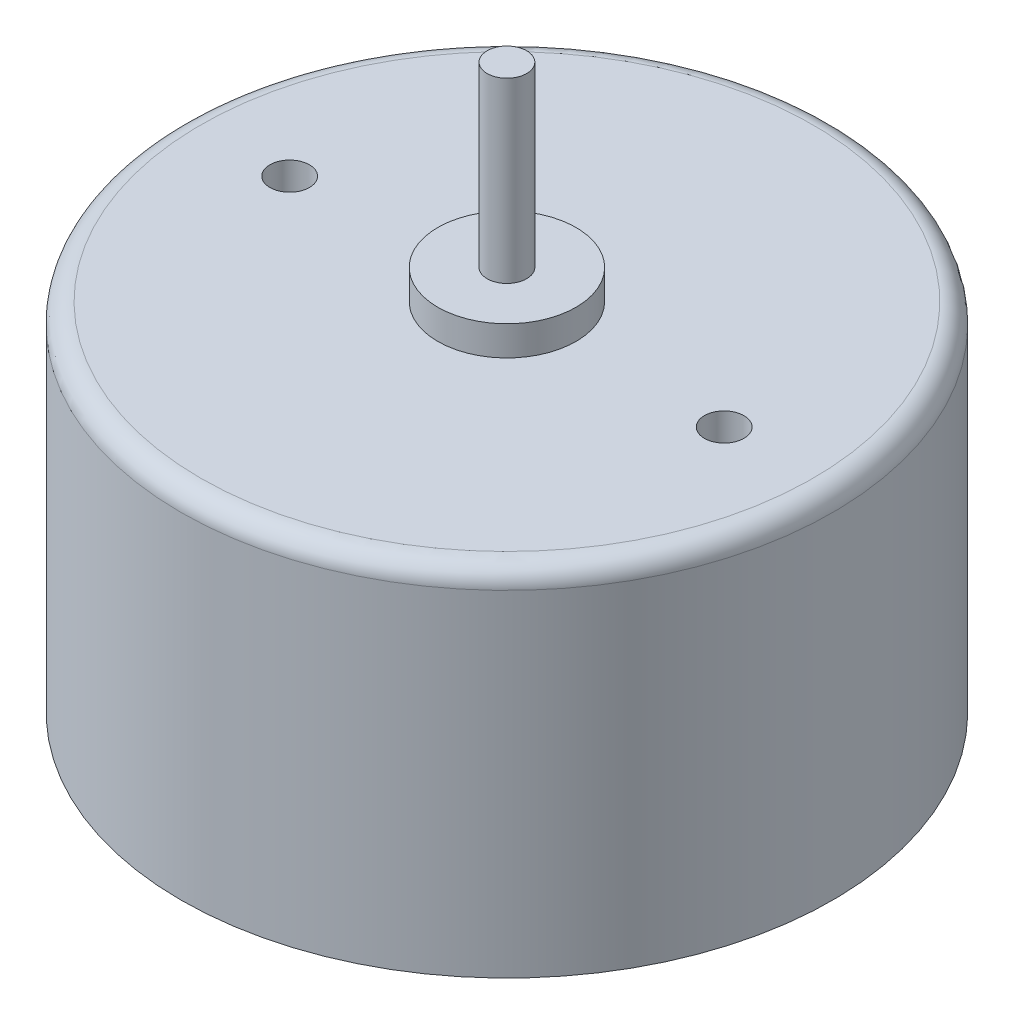
ISO-10303-21;
HEADER;
FILE_DESCRIPTION(('STEP AP214'),'2;1');
FILE_NAME('part.step','',(''),(''),'','','');
FILE_SCHEMA(('AUTOMOTIVE_DESIGN { 1 0 10303 214 1 1 1 1 }'));
ENDSEC;
DATA;
#1=APPLICATION_CONTEXT('core data for automotive mechanical design processes');
#2=APPLICATION_PROTOCOL_DEFINITION('international standard','automotive_design',2000,#1);
#3=PRODUCT_CONTEXT('',#1,'mechanical');
#4=PRODUCT('Part','Part','',(#3));
#5=PRODUCT_RELATED_PRODUCT_CATEGORY('part','',(#4));
#6=PRODUCT_DEFINITION_FORMATION('','',#4);
#7=PRODUCT_DEFINITION_CONTEXT('part definition',#1,'design');
#8=PRODUCT_DEFINITION('design','',#6,#7);
#9=PRODUCT_DEFINITION_SHAPE('','',#8);
#10=(LENGTH_UNIT() NAMED_UNIT(*) SI_UNIT(.MILLI.,.METRE.));
#11=(NAMED_UNIT(*) PLANE_ANGLE_UNIT() SI_UNIT($,.RADIAN.));
#12=(NAMED_UNIT(*) SI_UNIT($,.STERADIAN.) SOLID_ANGLE_UNIT());
#13=UNCERTAINTY_MEASURE_WITH_UNIT(LENGTH_MEASURE(1.E-05),#10,'distance_accuracy_value','');
#14=(GEOMETRIC_REPRESENTATION_CONTEXT(3) GLOBAL_UNCERTAINTY_ASSIGNED_CONTEXT((#13)) GLOBAL_UNIT_ASSIGNED_CONTEXT((#10,
#11,#12)) REPRESENTATION_CONTEXT('',''));
#15=CARTESIAN_POINT('',(0.,0.,0.));
#16=DIRECTION('',(0.,0.,1.));
#17=DIRECTION('',(1.,0.,0.));
#18=AXIS2_PLACEMENT_3D('',#15,#16,#17);
#19=CARTESIAN_POINT('',(0.,18.,0.));
#20=DIRECTION('',(0.,-1.,0.));
#21=DIRECTION('',(0.,0.,-1.));
#22=AXIS2_PLACEMENT_3D('',#19,#20,#21);
#23=CYLINDRICAL_SURFACE('',#22,16.5);
#24=CARTESIAN_POINT('',(0.,17.,0.));
#25=DIRECTION('',(0.,1.,0.));
#26=DIRECTION('',(0.,0.,1.));
#27=AXIS2_PLACEMENT_3D('',#24,#25,#26);
#28=CIRCLE('',#27,16.5);
#29=CARTESIAN_POINT('',(0.,17.,16.5));
#30=VERTEX_POINT('',#29);
#31=EDGE_CURVE('E10',#30,#30,#28,.F.);
#32=ORIENTED_EDGE('',*,*,#31,.T.);
#33=EDGE_LOOP('',(#32));
#34=FACE_BOUND('',#33,.T.);
#35=CARTESIAN_POINT('',(0.,0.,0.));
#36=DIRECTION('',(0.,1.,0.));
#37=DIRECTION('',(0.,0.,1.));
#38=AXIS2_PLACEMENT_3D('',#35,#36,#37);
#39=CIRCLE('',#38,16.5);
#40=CARTESIAN_POINT('',(0.,0.,16.5));
#41=VERTEX_POINT('',#40);
#42=EDGE_CURVE('E50',#41,#41,#39,.T.);
#43=ORIENTED_EDGE('',*,*,#42,.T.);
#44=EDGE_LOOP('',(#43));
#45=FACE_BOUND('',#44,.T.);
#46=ADVANCED_FACE('F32',(#34,#45),#23,.T.);
#47=CARTESIAN_POINT('',(0.,18.,0.));
#48=DIRECTION('',(0.,1.,0.));
#49=DIRECTION('',(0.,0.,1.));
#50=AXIS2_PLACEMENT_3D('',#47,#48,#49);
#51=PLANE('',#50);
#52=CARTESIAN_POINT('',(11.,18.,0.));
#53=DIRECTION('',(0.,1.,0.));
#54=DIRECTION('',(0.,0.,1.));
#55=AXIS2_PLACEMENT_3D('',#52,#53,#54);
#56=CIRCLE('',#55,1.);
#57=CARTESIAN_POINT('',(11.,18.,1.));
#58=VERTEX_POINT('',#57);
#59=EDGE_CURVE('E69',#58,#58,#56,.T.);
#60=ORIENTED_EDGE('',*,*,#59,.F.);
#61=EDGE_LOOP('',(#60));
#62=FACE_BOUND('',#61,.T.);
#63=CARTESIAN_POINT('',(-11.,18.,0.));
#64=DIRECTION('',(0.,1.,0.));
#65=DIRECTION('',(0.,0.,1.));
#66=AXIS2_PLACEMENT_3D('',#63,#64,#65);
#67=CIRCLE('',#66,1.);
#68=CARTESIAN_POINT('',(-11.,18.,0.999999999999925));
#69=VERTEX_POINT('',#68);
#70=EDGE_CURVE('E62',#69,#69,#67,.T.);
#71=ORIENTED_EDGE('',*,*,#70,.F.);
#72=EDGE_LOOP('',(#71));
#73=FACE_BOUND('',#72,.T.);
#74=CARTESIAN_POINT('',(0.,18.,0.));
#75=DIRECTION('',(0.,1.,0.));
#76=DIRECTION('',(0.,0.,1.));
#77=AXIS2_PLACEMENT_3D('',#74,#75,#76);
#78=CIRCLE('',#77,15.5);
#79=CARTESIAN_POINT('',(0.,18.,15.5));
#80=VERTEX_POINT('',#79);
#81=EDGE_CURVE('E39',#80,#80,#78,.T.);
#82=ORIENTED_EDGE('',*,*,#81,.T.);
#83=EDGE_LOOP('',(#82));
#84=FACE_BOUND('',#83,.T.);
#85=CARTESIAN_POINT('',(0.,18.,0.));
#86=DIRECTION('',(0.,1.,0.));
#87=DIRECTION('',(0.,0.,1.));
#88=AXIS2_PLACEMENT_3D('',#85,#86,#87);
#89=CIRCLE('',#88,3.5);
#90=CARTESIAN_POINT('',(0.,18.,3.5));
#91=VERTEX_POINT('',#90);
#92=EDGE_CURVE('E47',#91,#91,#89,.T.);
#93=ORIENTED_EDGE('',*,*,#92,.F.);
#94=EDGE_LOOP('',(#93));
#95=FACE_BOUND('',#94,.T.);
#96=ADVANCED_FACE('F106',(#62,#73,#84,#95),#51,.T.);
#97=CARTESIAN_POINT('',(0.,0.,0.));
#98=DIRECTION('',(0.,1.,0.));
#99=DIRECTION('',(0.,0.,1.));
#100=AXIS2_PLACEMENT_3D('',#97,#98,#99);
#101=PLANE('',#100);
#102=CARTESIAN_POINT('',(0.,0.,0.));
#103=DIRECTION('',(0.,-1.,0.));
#104=DIRECTION('',(0.,0.,-1.));
#105=AXIS2_PLACEMENT_3D('',#102,#103,#104);
#106=CIRCLE('',#105,15.8);
#107=CARTESIAN_POINT('',(0.,0.,-15.8));
#108=VERTEX_POINT('',#107);
#109=EDGE_CURVE('E77',#108,#108,#106,.T.);
#110=ORIENTED_EDGE('',*,*,#109,.F.);
#111=EDGE_LOOP('',(#110));
#112=FACE_BOUND('',#111,.T.);
#113=ORIENTED_EDGE('',*,*,#42,.F.);
#114=EDGE_LOOP('',(#113));
#115=FACE_BOUND('',#114,.T.);
#116=ADVANCED_FACE('F102',(#112,#115),#101,.F.);
#117=CARTESIAN_POINT('',(0.,19.5,0.));
#118=DIRECTION('',(0.,-1.,0.));
#119=DIRECTION('',(0.,0.,-1.));
#120=AXIS2_PLACEMENT_3D('',#117,#118,#119);
#121=CYLINDRICAL_SURFACE('',#120,3.5);
#122=CARTESIAN_POINT('',(0.,19.5,0.));
#123=DIRECTION('',(0.,1.,0.));
#124=DIRECTION('',(0.,0.,1.));
#125=AXIS2_PLACEMENT_3D('',#122,#123,#124);
#126=CIRCLE('',#125,3.5);
#127=CARTESIAN_POINT('',(0.,19.5,3.5));
#128=VERTEX_POINT('',#127);
#129=EDGE_CURVE('E53',#128,#128,#126,.T.);
#130=ORIENTED_EDGE('',*,*,#129,.F.);
#131=EDGE_LOOP('',(#130));
#132=FACE_BOUND('',#131,.T.);
#133=ORIENTED_EDGE('',*,*,#92,.T.);
#134=EDGE_LOOP('',(#133));
#135=FACE_BOUND('',#134,.T.);
#136=ADVANCED_FACE('F105',(#132,#135),#121,.T.);
#137=CARTESIAN_POINT('',(0.,19.5,0.));
#138=DIRECTION('',(0.,1.,0.));
#139=DIRECTION('',(0.,0.,1.));
#140=AXIS2_PLACEMENT_3D('',#137,#138,#139);
#141=PLANE('',#140);
#142=CARTESIAN_POINT('',(0.,19.5,0.));
#143=DIRECTION('',(0.,1.,0.));
#144=DIRECTION('',(0.,0.,1.));
#145=AXIS2_PLACEMENT_3D('',#142,#143,#144);
#146=CIRCLE('',#145,1.);
#147=CARTESIAN_POINT('',(0.,19.5,1.));
#148=VERTEX_POINT('',#147);
#149=EDGE_CURVE('E43',#148,#148,#146,.T.);
#150=ORIENTED_EDGE('',*,*,#149,.F.);
#151=EDGE_LOOP('',(#150));
#152=FACE_BOUND('',#151,.T.);
#153=ORIENTED_EDGE('',*,*,#129,.T.);
#154=EDGE_LOOP('',(#153));
#155=FACE_BOUND('',#154,.T.);
#156=ADVANCED_FACE('F119',(#152,#155),#141,.T.);
#157=CARTESIAN_POINT('',(0.,28.5,0.));
#158=DIRECTION('',(0.,-1.,0.));
#159=DIRECTION('',(0.,0.,-1.));
#160=AXIS2_PLACEMENT_3D('',#157,#158,#159);
#161=CYLINDRICAL_SURFACE('',#160,1.);
#162=CARTESIAN_POINT('',(0.,28.5,0.));
#163=DIRECTION('',(0.,1.,0.));
#164=DIRECTION('',(0.,0.,1.));
#165=AXIS2_PLACEMENT_3D('',#162,#163,#164);
#166=CIRCLE('',#165,1.);
#167=CARTESIAN_POINT('',(0.,28.5,1.));
#168=VERTEX_POINT('',#167);
#169=EDGE_CURVE('E57',#168,#168,#166,.T.);
#170=ORIENTED_EDGE('',*,*,#169,.F.);
#171=EDGE_LOOP('',(#170));
#172=FACE_BOUND('',#171,.T.);
#173=ORIENTED_EDGE('',*,*,#149,.T.);
#174=EDGE_LOOP('',(#173));
#175=FACE_BOUND('',#174,.T.);
#176=ADVANCED_FACE('F123',(#172,#175),#161,.T.);
#177=CARTESIAN_POINT('',(0.,28.5,0.));
#178=DIRECTION('',(0.,1.,0.));
#179=DIRECTION('',(0.,0.,1.));
#180=AXIS2_PLACEMENT_3D('',#177,#178,#179);
#181=PLANE('',#180);
#182=ORIENTED_EDGE('',*,*,#169,.T.);
#183=EDGE_LOOP('',(#182));
#184=FACE_BOUND('',#183,.T.);
#185=ADVANCED_FACE('F127',(#184),#181,.T.);
#186=CARTESIAN_POINT('',(0.,17.,0.));
#187=DIRECTION('',(0.,1.,0.));
#188=DIRECTION('',(0.,0.,1.));
#189=AXIS2_PLACEMENT_3D('',#186,#187,#188);
#190=TOROIDAL_SURFACE('',#189,15.5,1.);
#191=ORIENTED_EDGE('',*,*,#31,.F.);
#192=EDGE_LOOP('',(#191));
#193=FACE_BOUND('',#192,.T.);
#194=ORIENTED_EDGE('',*,*,#81,.F.);
#195=EDGE_LOOP('',(#194));
#196=FACE_BOUND('',#195,.T.);
#197=ADVANCED_FACE('F34',(#193,#196),#190,.T.);
#198=CARTESIAN_POINT('',(-11.,16.5,0.));
#199=DIRECTION('',(0.,1.,0.));
#200=DIRECTION('',(0.,0.,1.));
#201=AXIS2_PLACEMENT_3D('',#198,#199,#200);
#202=CYLINDRICAL_SURFACE('',#201,1.);
#203=CARTESIAN_POINT('',(-11.,16.5,0.));
#204=DIRECTION('',(0.,1.,0.));
#205=DIRECTION('',(0.,0.,1.));
#206=AXIS2_PLACEMENT_3D('',#203,#204,#205);
#207=CIRCLE('',#206,1.);
#208=CARTESIAN_POINT('',(-11.,16.5,0.999999999999925));
#209=VERTEX_POINT('',#208);
#210=EDGE_CURVE('E65',#209,#209,#207,.T.);
#211=ORIENTED_EDGE('',*,*,#210,.F.);
#212=EDGE_LOOP('',(#211));
#213=FACE_BOUND('',#212,.T.);
#214=ORIENTED_EDGE('',*,*,#70,.T.);
#215=EDGE_LOOP('',(#214));
#216=FACE_BOUND('',#215,.T.);
#217=ADVANCED_FACE('F132',(#213,#216),#202,.F.);
#218=CARTESIAN_POINT('',(-11.,16.5,0.));
#219=DIRECTION('',(0.,1.,0.));
#220=DIRECTION('',(0.,0.,1.));
#221=AXIS2_PLACEMENT_3D('',#218,#219,#220);
#222=PLANE('',#221);
#223=ORIENTED_EDGE('',*,*,#210,.T.);
#224=EDGE_LOOP('',(#223));
#225=FACE_BOUND('',#224,.T.);
#226=ADVANCED_FACE('F135',(#225),#222,.T.);
#227=CARTESIAN_POINT('',(11.,16.5,0.));
#228=DIRECTION('',(0.,1.,0.));
#229=DIRECTION('',(0.,0.,1.));
#230=AXIS2_PLACEMENT_3D('',#227,#228,#229);
#231=CYLINDRICAL_SURFACE('',#230,1.);
#232=CARTESIAN_POINT('',(11.,16.5,0.));
#233=DIRECTION('',(0.,1.,0.));
#234=DIRECTION('',(0.,0.,1.));
#235=AXIS2_PLACEMENT_3D('',#232,#233,#234);
#236=CIRCLE('',#235,1.);
#237=CARTESIAN_POINT('',(11.,16.5,1.));
#238=VERTEX_POINT('',#237);
#239=EDGE_CURVE('E61',#238,#238,#236,.T.);
#240=ORIENTED_EDGE('',*,*,#239,.F.);
#241=EDGE_LOOP('',(#240));
#242=FACE_BOUND('',#241,.T.);
#243=ORIENTED_EDGE('',*,*,#59,.T.);
#244=EDGE_LOOP('',(#243));
#245=FACE_BOUND('',#244,.T.);
#246=ADVANCED_FACE('F139',(#242,#245),#231,.F.);
#247=CARTESIAN_POINT('',(11.,16.5,0.));
#248=DIRECTION('',(0.,1.,0.));
#249=DIRECTION('',(0.,0.,1.));
#250=AXIS2_PLACEMENT_3D('',#247,#248,#249);
#251=PLANE('',#250);
#252=ORIENTED_EDGE('',*,*,#239,.T.);
#253=EDGE_LOOP('',(#252));
#254=FACE_BOUND('',#253,.T.);
#255=ADVANCED_FACE('F98',(#254),#251,.T.);
#256=CARTESIAN_POINT('',(0.,0.5,0.));
#257=DIRECTION('',(0.,-1.,0.));
#258=DIRECTION('',(0.,0.,-1.));
#259=AXIS2_PLACEMENT_3D('',#256,#257,#258);
#260=CYLINDRICAL_SURFACE('',#259,15.8);
#261=CARTESIAN_POINT('',(0.,0.5,0.));
#262=DIRECTION('',(0.,-1.,0.));
#263=DIRECTION('',(0.,0.,-1.));
#264=AXIS2_PLACEMENT_3D('',#261,#262,#263);
#265=CIRCLE('',#264,15.8);
#266=CARTESIAN_POINT('',(0.,0.5,-15.8));
#267=VERTEX_POINT('',#266);
#268=EDGE_CURVE('E76',#267,#267,#265,.T.);
#269=ORIENTED_EDGE('',*,*,#268,.F.);
#270=EDGE_LOOP('',(#269));
#271=FACE_BOUND('',#270,.T.);
#272=ORIENTED_EDGE('',*,*,#109,.T.);
#273=EDGE_LOOP('',(#272));
#274=FACE_BOUND('',#273,.T.);
#275=ADVANCED_FACE('F92',(#271,#274),#260,.F.);
#276=CARTESIAN_POINT('',(0.,0.5,0.));
#277=DIRECTION('',(0.,-1.,0.));
#278=DIRECTION('',(0.,0.,-1.));
#279=AXIS2_PLACEMENT_3D('',#276,#277,#278);
#280=PLANE('',#279);
#281=CARTESIAN_POINT('',(0.,0.5,0.));
#282=DIRECTION('',(0.,-1.,0.));
#283=DIRECTION('',(0.,0.,-1.));
#284=AXIS2_PLACEMENT_3D('',#281,#282,#283);
#285=CIRCLE('',#284,3.5);
#286=CARTESIAN_POINT('',(0.,0.5,-3.5));
#287=VERTEX_POINT('',#286);
#288=EDGE_CURVE('E80',#287,#287,#285,.T.);
#289=ORIENTED_EDGE('',*,*,#288,.F.);
#290=EDGE_LOOP('',(#289));
#291=FACE_BOUND('',#290,.T.);
#292=ORIENTED_EDGE('',*,*,#268,.T.);
#293=EDGE_LOOP('',(#292));
#294=FACE_BOUND('',#293,.T.);
#295=ADVANCED_FACE('F88',(#291,#294),#280,.T.);
#296=CARTESIAN_POINT('',(0.,-3.,0.));
#297=DIRECTION('',(0.,-1.,0.));
#298=DIRECTION('',(0.,0.,-1.));
#299=AXIS2_PLACEMENT_3D('',#296,#297,#298);
#300=PLANE('',#299);
#301=CARTESIAN_POINT('',(0.,-3.,0.));
#302=DIRECTION('',(0.,-1.,0.));
#303=DIRECTION('',(0.,0.,-1.));
#304=AXIS2_PLACEMENT_3D('',#301,#302,#303);
#305=CIRCLE('',#304,3.5);
#306=CARTESIAN_POINT('',(0.,-3.,-3.5));
#307=VERTEX_POINT('',#306);
#308=EDGE_CURVE('E66',#307,#307,#305,.T.);
#309=ORIENTED_EDGE('',*,*,#308,.T.);
#310=EDGE_LOOP('',(#309));
#311=FACE_BOUND('',#310,.T.);
#312=ADVANCED_FACE('F91',(#311),#300,.T.);
#313=CARTESIAN_POINT('',(0.,-3.,0.));
#314=DIRECTION('',(0.,1.,0.));
#315=DIRECTION('',(0.,0.,1.));
#316=AXIS2_PLACEMENT_3D('',#313,#314,#315);
#317=CYLINDRICAL_SURFACE('',#316,3.5);
#318=ORIENTED_EDGE('',*,*,#308,.F.);
#319=EDGE_LOOP('',(#318));
#320=FACE_BOUND('',#319,.T.);
#321=ORIENTED_EDGE('',*,*,#288,.T.);
#322=EDGE_LOOP('',(#321));
#323=FACE_BOUND('',#322,.T.);
#324=ADVANCED_FACE('F86',(#320,#323),#317,.T.);
#325=CLOSED_SHELL('',(#46,#96,#116,#136,#156,#176,#185,#197,#217,#226,#246,#255,#275,#295,#312,#324));
#326=MANIFOLD_SOLID_BREP('B2',#325);
#327=ADVANCED_BREP_SHAPE_REPRESENTATION('',(#18,#326),#14);
#328=SHAPE_DEFINITION_REPRESENTATION(#9,#327);
ENDSEC;
END-ISO-10303-21;
